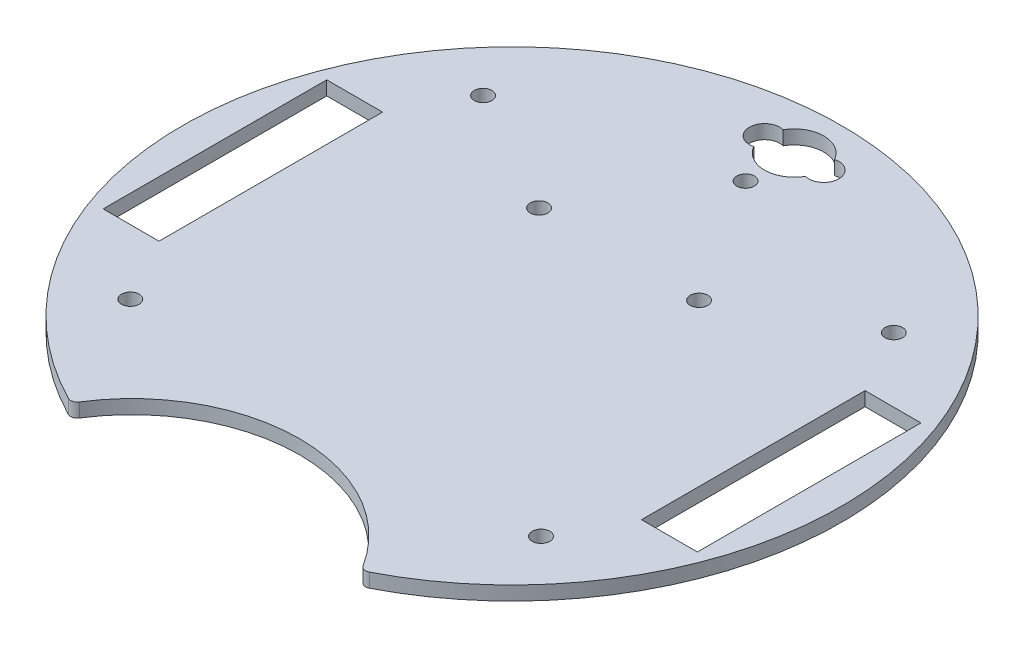
ISO-10303-21;
HEADER;
FILE_DESCRIPTION(('STEP AP214'),'2;1');
FILE_NAME('part.step','',(''),(''),'','','');
FILE_SCHEMA(('AUTOMOTIVE_DESIGN { 1 0 10303 214 1 1 1 1 }'));
ENDSEC;
DATA;
#1=APPLICATION_CONTEXT('core data for automotive mechanical design processes');
#2=APPLICATION_PROTOCOL_DEFINITION('international standard','automotive_design',2000,#1);
#3=PRODUCT_CONTEXT('',#1,'mechanical');
#4=PRODUCT('Part','Part','',(#3));
#5=PRODUCT_RELATED_PRODUCT_CATEGORY('part','',(#4));
#6=PRODUCT_DEFINITION_FORMATION('','',#4);
#7=PRODUCT_DEFINITION_CONTEXT('part definition',#1,'design');
#8=PRODUCT_DEFINITION('design','',#6,#7);
#9=PRODUCT_DEFINITION_SHAPE('','',#8);
#10=(LENGTH_UNIT() NAMED_UNIT(*) SI_UNIT(.MILLI.,.METRE.));
#11=(NAMED_UNIT(*) PLANE_ANGLE_UNIT() SI_UNIT($,.RADIAN.));
#12=(NAMED_UNIT(*) SI_UNIT($,.STERADIAN.) SOLID_ANGLE_UNIT());
#13=UNCERTAINTY_MEASURE_WITH_UNIT(LENGTH_MEASURE(1.E-05),#10,'distance_accuracy_value','');
#14=(GEOMETRIC_REPRESENTATION_CONTEXT(3) GLOBAL_UNCERTAINTY_ASSIGNED_CONTEXT((#13)) GLOBAL_UNIT_ASSIGNED_CONTEXT((#10,
#11,#12)) REPRESENTATION_CONTEXT('',''));
#15=CARTESIAN_POINT('',(0.,0.,0.));
#16=DIRECTION('',(0.,0.,1.));
#17=DIRECTION('',(1.,0.,0.));
#18=AXIS2_PLACEMENT_3D('',#15,#16,#17);
#19=CARTESIAN_POINT('',(0.,3.175,-64.1076988434385));
#20=DIRECTION('',(0.,-1.,0.));
#21=DIRECTION('',(0.,0.,-1.));
#22=AXIS2_PLACEMENT_3D('',#19,#20,#21);
#23=CYLINDRICAL_SURFACE('',#22,6.731);
#24=CARTESIAN_POINT('',(0.,0.,-64.1076988434385));
#25=DIRECTION('',(0.,1.,0.));
#26=DIRECTION('',(0.,0.,1.));
#27=AXIS2_PLACEMENT_3D('',#24,#25,#26);
#28=CIRCLE('',#27,6.731);
#29=CARTESIAN_POINT('',(-5.85389998799957,0.,-60.7853177800295));
#30=VERTEX_POINT('',#29);
#31=CARTESIAN_POINT('',(5.85757547169812,0.,-60.7918021934567));
#32=VERTEX_POINT('',#31);
#33=EDGE_CURVE('E236',#30,#32,#28,.T.);
#34=ORIENTED_EDGE('',*,*,#33,.F.);
#35=DIRECTION('',(0.,-1.,0.));
#36=VECTOR('',#35,1.);
#37=CARTESIAN_POINT('',(-5.85389998799957,3.175,-60.7853177800295));
#38=LINE('',#37,#36);
#39=CARTESIAN_POINT('',(-5.85389998799957,3.175,-60.7853177800295));
#40=VERTEX_POINT('',#39);
#41=EDGE_CURVE('E11',#40,#30,#38,.T.);
#42=ORIENTED_EDGE('',*,*,#41,.F.);
#43=CARTESIAN_POINT('',(0.,3.175,-64.1076988434385));
#44=DIRECTION('',(0.,1.,0.));
#45=DIRECTION('',(0.,0.,1.));
#46=AXIS2_PLACEMENT_3D('',#43,#44,#45);
#47=CIRCLE('',#46,6.731);
#48=CARTESIAN_POINT('',(5.85757547169812,3.175,-60.7918021934567));
#49=VERTEX_POINT('',#48);
#50=EDGE_CURVE('E171',#40,#49,#47,.T.);
#51=ORIENTED_EDGE('',*,*,#50,.T.);
#52=DIRECTION('',(0.,-1.,0.));
#53=VECTOR('',#52,1.);
#54=CARTESIAN_POINT('',(5.85757547169812,3.175,-60.7918021934567));
#55=LINE('',#54,#53);
#56=EDGE_CURVE('E54',#49,#32,#55,.T.);
#57=ORIENTED_EDGE('',*,*,#56,.T.);
#58=EDGE_LOOP('',(#34,#42,#51,#57));
#59=FACE_BOUND('',#58,.T.);
#60=ADVANCED_FACE('F35',(#59),#23,.F.);
#61=CARTESIAN_POINT('',(-6.731,3.175,-64.1076988434385));
#62=DIRECTION('',(0.,-1.,0.));
#63=DIRECTION('',(0.,0.,-1.));
#64=AXIS2_PLACEMENT_3D('',#61,#62,#63);
#65=CYLINDRICAL_SURFACE('',#64,3.43620726405579);
#66=CARTESIAN_POINT('',(-6.731,0.,-64.1076988434385));
#67=DIRECTION('',(0.,1.,0.));
#68=DIRECTION('',(0.,0.,1.));
#69=AXIS2_PLACEMENT_3D('',#66,#67,#68);
#70=CIRCLE('',#69,3.43620726405579);
#71=CARTESIAN_POINT('',(-5.85389998799957,0.,-67.4300799068475));
#72=VERTEX_POINT('',#71);
#73=EDGE_CURVE('E159',#72,#30,#70,.T.);
#74=ORIENTED_EDGE('',*,*,#73,.F.);
#75=DIRECTION('',(0.,-1.,0.));
#76=VECTOR('',#75,1.);
#77=CARTESIAN_POINT('',(-5.85389998799957,3.175,-67.4300799068475));
#78=LINE('',#77,#76);
#79=CARTESIAN_POINT('',(-5.85389998799957,3.175,-67.4300799068475));
#80=VERTEX_POINT('',#79);
#81=EDGE_CURVE('E45',#80,#72,#78,.T.);
#82=ORIENTED_EDGE('',*,*,#81,.F.);
#83=CARTESIAN_POINT('',(-6.731,3.175,-64.1076988434385));
#84=DIRECTION('',(0.,1.,0.));
#85=DIRECTION('',(0.,0.,1.));
#86=AXIS2_PLACEMENT_3D('',#83,#84,#85);
#87=CIRCLE('',#86,3.43620726405579);
#88=EDGE_CURVE('E157',#80,#40,#87,.T.);
#89=ORIENTED_EDGE('',*,*,#88,.T.);
#90=ORIENTED_EDGE('',*,*,#41,.T.);
#91=EDGE_LOOP('',(#74,#82,#89,#90));
#92=FACE_BOUND('',#91,.T.);
#93=ADVANCED_FACE('F156',(#92),#65,.F.);
#94=CARTESIAN_POINT('',(0.,3.175,-64.1076988434385));
#95=DIRECTION('',(0.,-1.,0.));
#96=DIRECTION('',(0.,0.,-1.));
#97=AXIS2_PLACEMENT_3D('',#94,#95,#96);
#98=CYLINDRICAL_SURFACE('',#97,6.731);
#99=CARTESIAN_POINT('',(0.,0.,-64.1076988434385));
#100=DIRECTION('',(0.,1.,0.));
#101=DIRECTION('',(0.,0.,1.));
#102=AXIS2_PLACEMENT_3D('',#99,#100,#101);
#103=CIRCLE('',#102,6.731);
#104=CARTESIAN_POINT('',(5.8575754716981,0.,-67.4235954934203));
#105=VERTEX_POINT('',#104);
#106=EDGE_CURVE('E239',#105,#72,#103,.T.);
#107=ORIENTED_EDGE('',*,*,#106,.F.);
#108=DIRECTION('',(0.,-1.,0.));
#109=VECTOR('',#108,1.);
#110=CARTESIAN_POINT('',(5.8575754716981,3.175,-67.4235954934203));
#111=LINE('',#110,#109);
#112=CARTESIAN_POINT('',(5.8575754716981,3.175,-67.4235954934203));
#113=VERTEX_POINT('',#112);
#114=EDGE_CURVE('E103',#113,#105,#111,.T.);
#115=ORIENTED_EDGE('',*,*,#114,.F.);
#116=CARTESIAN_POINT('',(0.,3.175,-64.1076988434385));
#117=DIRECTION('',(0.,1.,0.));
#118=DIRECTION('',(0.,0.,1.));
#119=AXIS2_PLACEMENT_3D('',#116,#117,#118);
#120=CIRCLE('',#119,6.731);
#121=EDGE_CURVE('E170',#113,#80,#120,.T.);
#122=ORIENTED_EDGE('',*,*,#121,.T.);
#123=ORIENTED_EDGE('',*,*,#81,.T.);
#124=EDGE_LOOP('',(#107,#115,#122,#123));
#125=FACE_BOUND('',#124,.T.);
#126=ADVANCED_FACE('F173',(#125),#98,.F.);
#127=CARTESIAN_POINT('',(0.,3.175,-25.4000000000001));
#128=DIRECTION('',(0.,0.,-1.));
#129=DIRECTION('',(-1.,0.,0.));
#130=AXIS2_PLACEMENT_3D('',#127,#128,#129);
#131=PLANE('',#130);
#132=DIRECTION('',(1.,0.,0.));
#133=VECTOR('',#132,1.);
#134=CARTESIAN_POINT('',(0.,0.,-25.4000000000001));
#135=LINE('',#134,#133);
#136=CARTESIAN_POINT('',(-67.5141237268841,0.,-25.4000000000001));
#137=VERTEX_POINT('',#136);
#138=CARTESIAN_POINT('',(-54.8141237268841,0.,-25.4000000000001));
#139=VERTEX_POINT('',#138);
#140=EDGE_CURVE('E225',#137,#139,#135,.T.);
#141=ORIENTED_EDGE('',*,*,#140,.T.);
#142=DIRECTION('',(0.,-1.,0.));
#143=VECTOR('',#142,1.);
#144=CARTESIAN_POINT('',(-54.8141237268841,3.175,-25.4000000000001));
#145=LINE('',#144,#143);
#146=CARTESIAN_POINT('',(-54.8141237268841,3.175,-25.4000000000001));
#147=VERTEX_POINT('',#146);
#148=EDGE_CURVE('E252',#147,#139,#145,.T.);
#149=ORIENTED_EDGE('',*,*,#148,.F.);
#150=DIRECTION('',(1.,0.,0.));
#151=VECTOR('',#150,1.);
#152=CARTESIAN_POINT('',(0.,3.175,-25.4000000000001));
#153=LINE('',#152,#151);
#154=CARTESIAN_POINT('',(-67.5141237268841,3.175,-25.4000000000001));
#155=VERTEX_POINT('',#154);
#156=EDGE_CURVE('E560',#155,#147,#153,.T.);
#157=ORIENTED_EDGE('',*,*,#156,.F.);
#158=DIRECTION('',(0.,-1.,0.));
#159=VECTOR('',#158,1.);
#160=CARTESIAN_POINT('',(-67.5141237268841,3.175,-25.4000000000001));
#161=LINE('',#160,#159);
#162=EDGE_CURVE('E254',#155,#137,#161,.T.);
#163=ORIENTED_EDGE('',*,*,#162,.T.);
#164=EDGE_LOOP('',(#141,#149,#157,#163));
#165=FACE_BOUND('',#164,.T.);
#166=ADVANCED_FACE('F330',(#165),#131,.F.);
#167=CARTESIAN_POINT('',(-54.8141237268841,3.175,0.));
#168=DIRECTION('',(1.,0.,0.));
#169=DIRECTION('',(0.,0.,-1.));
#170=AXIS2_PLACEMENT_3D('',#167,#168,#169);
#171=PLANE('',#170);
#172=DIRECTION('',(0.,0.,1.));
#173=VECTOR('',#172,1.);
#174=CARTESIAN_POINT('',(-54.8141237268841,0.,0.));
#175=LINE('',#174,#173);
#176=CARTESIAN_POINT('',(-54.8141237268841,0.,25.3999999999999));
#177=VERTEX_POINT('',#176);
#178=EDGE_CURVE('E228',#139,#177,#175,.T.);
#179=ORIENTED_EDGE('',*,*,#178,.T.);
#180=DIRECTION('',(0.,-1.,0.));
#181=VECTOR('',#180,1.);
#182=CARTESIAN_POINT('',(-54.8141237268841,3.175,25.3999999999999));
#183=LINE('',#182,#181);
#184=CARTESIAN_POINT('',(-54.8141237268841,3.175,25.3999999999999));
#185=VERTEX_POINT('',#184);
#186=EDGE_CURVE('E260',#185,#177,#183,.T.);
#187=ORIENTED_EDGE('',*,*,#186,.F.);
#188=DIRECTION('',(0.,0.,1.));
#189=VECTOR('',#188,1.);
#190=CARTESIAN_POINT('',(-54.8141237268841,3.175,0.));
#191=LINE('',#190,#189);
#192=EDGE_CURVE('E563',#147,#185,#191,.T.);
#193=ORIENTED_EDGE('',*,*,#192,.F.);
#194=ORIENTED_EDGE('',*,*,#148,.T.);
#195=EDGE_LOOP('',(#179,#187,#193,#194));
#196=FACE_BOUND('',#195,.T.);
#197=ADVANCED_FACE('F326',(#196),#171,.F.);
#198=CARTESIAN_POINT('',(0.,3.175,25.3999999999999));
#199=DIRECTION('',(0.,0.,-1.));
#200=DIRECTION('',(-1.,0.,0.));
#201=AXIS2_PLACEMENT_3D('',#198,#199,#200);
#202=PLANE('',#201);
#203=DIRECTION('',(1.,0.,0.));
#204=VECTOR('',#203,1.);
#205=CARTESIAN_POINT('',(0.,0.,25.3999999999999));
#206=LINE('',#205,#204);
#207=CARTESIAN_POINT('',(-67.5141237268841,0.,25.3999999999999));
#208=VERTEX_POINT('',#207);
#209=EDGE_CURVE('E231',#208,#177,#206,.T.);
#210=ORIENTED_EDGE('',*,*,#209,.F.);
#211=DIRECTION('',(0.,-1.,0.));
#212=VECTOR('',#211,1.);
#213=CARTESIAN_POINT('',(-67.5141237268841,3.175,25.3999999999999));
#214=LINE('',#213,#212);
#215=CARTESIAN_POINT('',(-67.5141237268841,3.175,25.3999999999999));
#216=VERTEX_POINT('',#215);
#217=EDGE_CURVE('E257',#216,#208,#214,.T.);
#218=ORIENTED_EDGE('',*,*,#217,.F.);
#219=DIRECTION('',(1.,0.,0.));
#220=VECTOR('',#219,1.);
#221=CARTESIAN_POINT('',(0.,3.175,25.3999999999999));
#222=LINE('',#221,#220);
#223=EDGE_CURVE('E572',#216,#185,#222,.T.);
#224=ORIENTED_EDGE('',*,*,#223,.T.);
#225=ORIENTED_EDGE('',*,*,#186,.T.);
#226=EDGE_LOOP('',(#210,#218,#224,#225));
#227=FACE_BOUND('',#226,.T.);
#228=ADVANCED_FACE('F322',(#227),#202,.T.);
#229=CARTESIAN_POINT('',(67.5141237268841,3.175,0.));
#230=DIRECTION('',(-1.,0.,0.));
#231=DIRECTION('',(0.,0.,1.));
#232=AXIS2_PLACEMENT_3D('',#229,#230,#231);
#233=PLANE('',#232);
#234=DIRECTION('',(0.,0.,-1.));
#235=VECTOR('',#234,1.);
#236=CARTESIAN_POINT('',(67.5141237268841,0.,0.));
#237=LINE('',#236,#235);
#238=CARTESIAN_POINT('',(67.5141237268841,0.,25.3999999999999));
#239=VERTEX_POINT('',#238);
#240=CARTESIAN_POINT('',(67.5141237268841,0.,-25.4000000000001));
#241=VERTEX_POINT('',#240);
#242=EDGE_CURVE('E213',#239,#241,#237,.T.);
#243=ORIENTED_EDGE('',*,*,#242,.F.);
#244=DIRECTION('',(0.,-1.,0.));
#245=VECTOR('',#244,1.);
#246=CARTESIAN_POINT('',(67.5141237268841,3.175,25.3999999999999));
#247=LINE('',#246,#245);
#248=CARTESIAN_POINT('',(67.5141237268841,3.175,25.3999999999999));
#249=VERTEX_POINT('',#248);
#250=EDGE_CURVE('E258',#249,#239,#247,.T.);
#251=ORIENTED_EDGE('',*,*,#250,.F.);
#252=DIRECTION('',(0.,0.,-1.));
#253=VECTOR('',#252,1.);
#254=CARTESIAN_POINT('',(67.5141237268841,3.175,0.));
#255=LINE('',#254,#253);
#256=CARTESIAN_POINT('',(67.5141237268841,3.175,-25.4000000000001));
#257=VERTEX_POINT('',#256);
#258=EDGE_CURVE('E557',#249,#257,#255,.T.);
#259=ORIENTED_EDGE('',*,*,#258,.T.);
#260=DIRECTION('',(0.,-1.,0.));
#261=VECTOR('',#260,1.);
#262=CARTESIAN_POINT('',(67.5141237268841,3.175,-25.4000000000001));
#263=LINE('',#262,#261);
#264=EDGE_CURVE('E264',#257,#241,#263,.T.);
#265=ORIENTED_EDGE('',*,*,#264,.T.);
#266=EDGE_LOOP('',(#243,#251,#259,#265));
#267=FACE_BOUND('',#266,.T.);
#268=ADVANCED_FACE('F325',(#267),#233,.T.);
#269=CARTESIAN_POINT('',(0.,3.175,25.3999999999999));
#270=DIRECTION('',(0.,0.,1.));
#271=DIRECTION('',(1.,0.,0.));
#272=AXIS2_PLACEMENT_3D('',#269,#270,#271);
#273=PLANE('',#272);
#274=DIRECTION('',(-1.,0.,0.));
#275=VECTOR('',#274,1.);
#276=CARTESIAN_POINT('',(0.,0.,25.3999999999999));
#277=LINE('',#276,#275);
#278=CARTESIAN_POINT('',(54.8141237268841,0.,25.3999999999999));
#279=VERTEX_POINT('',#278);
#280=EDGE_CURVE('E216',#239,#279,#277,.T.);
#281=ORIENTED_EDGE('',*,*,#280,.T.);
#282=DIRECTION('',(0.,-1.,0.));
#283=VECTOR('',#282,1.);
#284=CARTESIAN_POINT('',(54.8141237268841,3.175,25.3999999999999));
#285=LINE('',#284,#283);
#286=CARTESIAN_POINT('',(54.8141237268841,3.175,25.3999999999999));
#287=VERTEX_POINT('',#286);
#288=EDGE_CURVE('E268',#287,#279,#285,.T.);
#289=ORIENTED_EDGE('',*,*,#288,.F.);
#290=DIRECTION('',(-1.,0.,0.));
#291=VECTOR('',#290,1.);
#292=CARTESIAN_POINT('',(0.,3.175,25.3999999999999));
#293=LINE('',#292,#291);
#294=EDGE_CURVE('E588',#249,#287,#293,.T.);
#295=ORIENTED_EDGE('',*,*,#294,.F.);
#296=ORIENTED_EDGE('',*,*,#250,.T.);
#297=EDGE_LOOP('',(#281,#289,#295,#296));
#298=FACE_BOUND('',#297,.T.);
#299=ADVANCED_FACE('F342',(#298),#273,.F.);
#300=CARTESIAN_POINT('',(54.8141237268841,3.175,0.));
#301=DIRECTION('',(-1.,0.,0.));
#302=DIRECTION('',(0.,0.,1.));
#303=AXIS2_PLACEMENT_3D('',#300,#301,#302);
#304=PLANE('',#303);
#305=DIRECTION('',(0.,0.,-1.));
#306=VECTOR('',#305,1.);
#307=CARTESIAN_POINT('',(54.8141237268841,0.,0.));
#308=LINE('',#307,#306);
#309=CARTESIAN_POINT('',(54.8141237268841,0.,-25.4000000000001));
#310=VERTEX_POINT('',#309);
#311=EDGE_CURVE('E219',#279,#310,#308,.T.);
#312=ORIENTED_EDGE('',*,*,#311,.T.);
#313=DIRECTION('',(0.,-1.,0.));
#314=VECTOR('',#313,1.);
#315=CARTESIAN_POINT('',(54.8141237268841,3.175,-25.4000000000001));
#316=LINE('',#315,#314);
#317=CARTESIAN_POINT('',(54.8141237268841,3.175,-25.4000000000001));
#318=VERTEX_POINT('',#317);
#319=EDGE_CURVE('E266',#318,#310,#316,.T.);
#320=ORIENTED_EDGE('',*,*,#319,.F.);
#321=DIRECTION('',(0.,0.,-1.));
#322=VECTOR('',#321,1.);
#323=CARTESIAN_POINT('',(54.8141237268841,3.175,0.));
#324=LINE('',#323,#322);
#325=EDGE_CURVE('E586',#287,#318,#324,.T.);
#326=ORIENTED_EDGE('',*,*,#325,.F.);
#327=ORIENTED_EDGE('',*,*,#288,.T.);
#328=EDGE_LOOP('',(#312,#320,#326,#327));
#329=FACE_BOUND('',#328,.T.);
#330=ADVANCED_FACE('F339',(#329),#304,.F.);
#331=CARTESIAN_POINT('',(33.5100001196225,3.175,65.3012960955778));
#332=DIRECTION('',(0.,-1.,0.));
#333=DIRECTION('',(0.,0.,-1.));
#334=AXIS2_PLACEMENT_3D('',#331,#332,#333);
#335=CYLINDRICAL_SURFACE('',#334,1.50000000000011);
#336=CARTESIAN_POINT('',(33.5100001196225,0.,65.3012960955778));
#337=DIRECTION('',(0.,1.,0.));
#338=DIRECTION('',(0.,0.,1.));
#339=AXIS2_PLACEMENT_3D('',#336,#337,#338);
#340=CIRCLE('',#339,1.50000000000011);
#341=CARTESIAN_POINT('',(34.1948335778492,0.,66.6358383895849));
#342=VERTEX_POINT('',#341);
#343=CARTESIAN_POINT('',(32.2406819332729,0.,66.100565350462));
#344=VERTEX_POINT('',#343);
#345=EDGE_CURVE('E192',#342,#344,#340,.F.);
#346=ORIENTED_EDGE('',*,*,#345,.F.);
#347=DIRECTION('',(0.,-1.,0.));
#348=VECTOR('',#347,1.);
#349=CARTESIAN_POINT('',(34.1948335778492,3.175,66.6358383895849));
#350=LINE('',#349,#348);
#351=CARTESIAN_POINT('',(34.1948335778492,3.175,66.6358383895849));
#352=VERTEX_POINT('',#351);
#353=EDGE_CURVE('E39',#352,#342,#350,.T.);
#354=ORIENTED_EDGE('',*,*,#353,.F.);
#355=CARTESIAN_POINT('',(33.5100001196225,3.175,65.3012960955778));
#356=DIRECTION('',(0.,1.,0.));
#357=DIRECTION('',(0.,0.,1.));
#358=AXIS2_PLACEMENT_3D('',#355,#356,#357);
#359=CIRCLE('',#358,1.50000000000011);
#360=CARTESIAN_POINT('',(32.2406819332729,3.175,66.100565350462));
#361=VERTEX_POINT('',#360);
#362=EDGE_CURVE('E289',#352,#361,#359,.F.);
#363=ORIENTED_EDGE('',*,*,#362,.T.);
#364=DIRECTION('',(0.,-1.,0.));
#365=VECTOR('',#364,1.);
#366=CARTESIAN_POINT('',(32.2406819332729,3.175,66.100565350462));
#367=LINE('',#366,#365);
#368=EDGE_CURVE('E185',#361,#344,#367,.T.);
#369=ORIENTED_EDGE('',*,*,#368,.T.);
#370=EDGE_LOOP('',(#346,#354,#363,#369));
#371=FACE_BOUND('',#370,.T.);
#372=ADVANCED_FACE('F288',(#371),#335,.T.);
#373=CARTESIAN_POINT('',(0.,3.175,0.));
#374=DIRECTION('',(0.,-1.,0.));
#375=DIRECTION('',(0.,0.,-1.));
#376=AXIS2_PLACEMENT_3D('',#373,#374,#375);
#377=CYLINDRICAL_SURFACE('',#376,74.8974071734108);
#378=CARTESIAN_POINT('',(0.,0.,0.));
#379=DIRECTION('',(0.,1.,0.));
#380=DIRECTION('',(0.,0.,1.));
#381=AXIS2_PLACEMENT_3D('',#378,#379,#380);
#382=CIRCLE('',#381,74.8974071734108);
#383=CARTESIAN_POINT('',(-34.1948335778492,0.,66.6358383895849));
#384=VERTEX_POINT('',#383);
#385=EDGE_CURVE('E195',#342,#384,#382,.T.);
#386=ORIENTED_EDGE('',*,*,#385,.T.);
#387=DIRECTION('',(0.,-1.,0.));
#388=VECTOR('',#387,1.);
#389=CARTESIAN_POINT('',(-34.1948335778492,3.175,66.6358383895849));
#390=LINE('',#389,#388);
#391=CARTESIAN_POINT('',(-34.1948335778492,3.175,66.6358383895849));
#392=VERTEX_POINT('',#391);
#393=EDGE_CURVE('E274',#392,#384,#390,.T.);
#394=ORIENTED_EDGE('',*,*,#393,.F.);
#395=CARTESIAN_POINT('',(0.,3.175,0.));
#396=DIRECTION('',(0.,1.,0.));
#397=DIRECTION('',(0.,0.,1.));
#398=AXIS2_PLACEMENT_3D('',#395,#396,#397);
#399=CIRCLE('',#398,74.8974071734108);
#400=EDGE_CURVE('E282',#352,#392,#399,.T.);
#401=ORIENTED_EDGE('',*,*,#400,.F.);
#402=ORIENTED_EDGE('',*,*,#353,.T.);
#403=EDGE_LOOP('',(#386,#394,#401,#402));
#404=FACE_BOUND('',#403,.T.);
#405=ADVANCED_FACE('F280',(#404),#377,.T.);
#406=CARTESIAN_POINT('',(-33.5100001196225,3.175,65.3012960955779));
#407=DIRECTION('',(0.,-1.,0.));
#408=DIRECTION('',(0.,0.,-1.));
#409=AXIS2_PLACEMENT_3D('',#406,#407,#408);
#410=CYLINDRICAL_SURFACE('',#409,1.50000000000026);
#411=CARTESIAN_POINT('',(-33.5100001196225,0.,65.3012960955779));
#412=DIRECTION('',(0.,1.,0.));
#413=DIRECTION('',(0.,0.,1.));
#414=AXIS2_PLACEMENT_3D('',#411,#412,#413);
#415=CIRCLE('',#414,1.50000000000026);
#416=CARTESIAN_POINT('',(-32.2406819332729,0.,66.100565350462));
#417=VERTEX_POINT('',#416);
#418=EDGE_CURVE('E198',#384,#417,#415,.T.);
#419=ORIENTED_EDGE('',*,*,#418,.T.);
#420=DIRECTION('',(0.,-1.,0.));
#421=VECTOR('',#420,1.);
#422=CARTESIAN_POINT('',(-32.2406819332729,3.175,66.100565350462));
#423=LINE('',#422,#421);
#424=CARTESIAN_POINT('',(-32.2406819332729,3.175,66.100565350462));
#425=VERTEX_POINT('',#424);
#426=EDGE_CURVE('E273',#425,#417,#423,.T.);
#427=ORIENTED_EDGE('',*,*,#426,.F.);
#428=CARTESIAN_POINT('',(-33.5100001196225,3.175,65.3012960955779));
#429=DIRECTION('',(0.,1.,0.));
#430=DIRECTION('',(0.,0.,1.));
#431=AXIS2_PLACEMENT_3D('',#428,#429,#430);
#432=CIRCLE('',#431,1.50000000000026);
#433=EDGE_CURVE('E595',#392,#425,#432,.T.);
#434=ORIENTED_EDGE('',*,*,#433,.F.);
#435=ORIENTED_EDGE('',*,*,#393,.T.);
#436=EDGE_LOOP('',(#419,#427,#434,#435));
#437=FACE_BOUND('',#436,.T.);
#438=ADVANCED_FACE('F296',(#437),#410,.T.);
#439=CARTESIAN_POINT('',(-18.1789527954067,3.175,-24.3105510962522));
#440=DIRECTION('',(0.,-1.,0.));
#441=DIRECTION('',(0.,0.,-1.));
#442=AXIS2_PLACEMENT_3D('',#439,#440,#441);
#443=CYLINDRICAL_SURFACE('',#442,2.);
#444=CARTESIAN_POINT('',(-18.1789527954067,3.175,-24.3105510962522));
#445=DIRECTION('',(0.,1.,0.));
#446=DIRECTION('',(0.,0.,1.));
#447=AXIS2_PLACEMENT_3D('',#444,#445,#446);
#448=CIRCLE('',#447,2.);
#449=CARTESIAN_POINT('',(-18.1789527954067,3.175,-22.3105510962522));
#450=VERTEX_POINT('',#449);
#451=EDGE_CURVE('E176',#450,#450,#448,.F.);
#452=ORIENTED_EDGE('',*,*,#451,.F.);
#453=EDGE_LOOP('',(#452));
#454=FACE_BOUND('',#453,.T.);
#455=CARTESIAN_POINT('',(-18.1789527954067,0.,-24.3105510962522));
#456=DIRECTION('',(0.,1.,0.));
#457=DIRECTION('',(0.,0.,1.));
#458=AXIS2_PLACEMENT_3D('',#455,#456,#457);
#459=CIRCLE('',#458,2.);
#460=CARTESIAN_POINT('',(-18.1789527954067,0.,-22.3105510962522));
#461=VERTEX_POINT('',#460);
#462=EDGE_CURVE('E244',#461,#461,#459,.F.);
#463=ORIENTED_EDGE('',*,*,#462,.T.);
#464=EDGE_LOOP('',(#463));
#465=FACE_BOUND('',#464,.T.);
#466=ADVANCED_FACE('F298',(#454,#465),#443,.F.);
#467=CARTESIAN_POINT('',(6.731,3.175,-64.1076988434385));
#468=DIRECTION('',(0.,-1.,0.));
#469=DIRECTION('',(0.,0.,-1.));
#470=AXIS2_PLACEMENT_3D('',#467,#468,#469);
#471=CYLINDRICAL_SURFACE('',#470,3.429);
#472=CARTESIAN_POINT('',(6.731,0.,-64.1076988434385));
#473=DIRECTION('',(0.,1.,0.));
#474=DIRECTION('',(0.,0.,1.));
#475=AXIS2_PLACEMENT_3D('',#472,#473,#474);
#476=CIRCLE('',#475,3.429);
#477=EDGE_CURVE('E241',#32,#105,#476,.T.);
#478=ORIENTED_EDGE('',*,*,#477,.F.);
#479=ORIENTED_EDGE('',*,*,#56,.F.);
#480=CARTESIAN_POINT('',(6.731,3.175,-64.1076988434385));
#481=DIRECTION('',(0.,1.,0.));
#482=DIRECTION('',(0.,0.,1.));
#483=AXIS2_PLACEMENT_3D('',#480,#481,#482);
#484=CIRCLE('',#483,3.429);
#485=EDGE_CURVE('E174',#49,#113,#484,.T.);
#486=ORIENTED_EDGE('',*,*,#485,.T.);
#487=ORIENTED_EDGE('',*,*,#114,.T.);
#488=EDGE_LOOP('',(#478,#479,#486,#487));
#489=FACE_BOUND('',#488,.T.);
#490=ADVANCED_FACE('F304',(#489),#471,.F.);
#491=CARTESIAN_POINT('',(-67.5141237268841,3.175,0.));
#492=DIRECTION('',(-1.,0.,0.));
#493=DIRECTION('',(0.,0.,1.));
#494=AXIS2_PLACEMENT_3D('',#491,#492,#493);
#495=PLANE('',#494);
#496=DIRECTION('',(0.,0.,-1.));
#497=VECTOR('',#496,1.);
#498=CARTESIAN_POINT('',(-67.5141237268841,0.,0.));
#499=LINE('',#498,#497);
#500=EDGE_CURVE('E234',#208,#137,#499,.T.);
#501=ORIENTED_EDGE('',*,*,#500,.T.);
#502=ORIENTED_EDGE('',*,*,#162,.F.);
#503=DIRECTION('',(0.,0.,-1.));
#504=VECTOR('',#503,1.);
#505=CARTESIAN_POINT('',(-67.5141237268841,3.175,0.));
#506=LINE('',#505,#504);
#507=EDGE_CURVE('E566',#216,#155,#506,.T.);
#508=ORIENTED_EDGE('',*,*,#507,.F.);
#509=ORIENTED_EDGE('',*,*,#217,.T.);
#510=EDGE_LOOP('',(#501,#502,#508,#509));
#511=FACE_BOUND('',#510,.T.);
#512=ADVANCED_FACE('F317',(#511),#495,.F.);
#513=CARTESIAN_POINT('',(0.,3.175,-25.4000000000001));
#514=DIRECTION('',(0.,0.,1.));
#515=DIRECTION('',(1.,0.,0.));
#516=AXIS2_PLACEMENT_3D('',#513,#514,#515);
#517=PLANE('',#516);
#518=DIRECTION('',(-1.,0.,0.));
#519=VECTOR('',#518,1.);
#520=CARTESIAN_POINT('',(0.,0.,-25.4000000000001));
#521=LINE('',#520,#519);
#522=EDGE_CURVE('E222',#241,#310,#521,.T.);
#523=ORIENTED_EDGE('',*,*,#522,.F.);
#524=ORIENTED_EDGE('',*,*,#264,.F.);
#525=DIRECTION('',(-1.,0.,0.));
#526=VECTOR('',#525,1.);
#527=CARTESIAN_POINT('',(0.,3.175,-25.4000000000001));
#528=LINE('',#527,#526);
#529=EDGE_CURVE('E568',#257,#318,#528,.T.);
#530=ORIENTED_EDGE('',*,*,#529,.T.);
#531=ORIENTED_EDGE('',*,*,#319,.T.);
#532=EDGE_LOOP('',(#523,#524,#530,#531));
#533=FACE_BOUND('',#532,.T.);
#534=ADVANCED_FACE('F320',(#533),#517,.T.);
#535=CARTESIAN_POINT('',(-46.6637339832601,3.175,40.0812318826666));
#536=DIRECTION('',(0.,-1.,0.));
#537=DIRECTION('',(0.,0.,-1.));
#538=AXIS2_PLACEMENT_3D('',#535,#536,#537);
#539=CYLINDRICAL_SURFACE('',#538,2.);
#540=CARTESIAN_POINT('',(-46.6637339832601,3.175,40.0812318826666));
#541=DIRECTION('',(0.,1.,0.));
#542=DIRECTION('',(0.,0.,1.));
#543=AXIS2_PLACEMENT_3D('',#540,#541,#542);
#544=CIRCLE('',#543,2.);
#545=CARTESIAN_POINT('',(-46.6637339832601,3.175,42.0812318826666));
#546=VERTEX_POINT('',#545);
#547=EDGE_CURVE('E551',#546,#546,#544,.T.);
#548=ORIENTED_EDGE('',*,*,#547,.T.);
#549=EDGE_LOOP('',(#548));
#550=FACE_BOUND('',#549,.T.);
#551=CARTESIAN_POINT('',(-46.6637339832601,0.,40.0812318826666));
#552=DIRECTION('',(0.,1.,0.));
#553=DIRECTION('',(0.,0.,1.));
#554=AXIS2_PLACEMENT_3D('',#551,#552,#553);
#555=CIRCLE('',#554,2.);
#556=CARTESIAN_POINT('',(-46.6637339832601,0.,42.0812318826666));
#557=VERTEX_POINT('',#556);
#558=EDGE_CURVE('E210',#557,#557,#555,.T.);
#559=ORIENTED_EDGE('',*,*,#558,.F.);
#560=EDGE_LOOP('',(#559));
#561=FACE_BOUND('',#560,.T.);
#562=ADVANCED_FACE('F337',(#550,#561),#539,.F.);
#563=CARTESIAN_POINT('',(46.6637339832601,3.175,40.0812318826666));
#564=DIRECTION('',(0.,-1.,0.));
#565=DIRECTION('',(0.,0.,-1.));
#566=AXIS2_PLACEMENT_3D('',#563,#564,#565);
#567=CYLINDRICAL_SURFACE('',#566,2.);
#568=CARTESIAN_POINT('',(46.6637339832601,3.175,40.0812318826666));
#569=DIRECTION('',(0.,1.,0.));
#570=DIRECTION('',(0.,0.,1.));
#571=AXIS2_PLACEMENT_3D('',#568,#569,#570);
#572=CIRCLE('',#571,2.);
#573=CARTESIAN_POINT('',(46.6637339832601,3.175,42.0812318826666));
#574=VERTEX_POINT('',#573);
#575=EDGE_CURVE('E547',#574,#574,#572,.T.);
#576=ORIENTED_EDGE('',*,*,#575,.T.);
#577=EDGE_LOOP('',(#576));
#578=FACE_BOUND('',#577,.T.);
#579=CARTESIAN_POINT('',(46.6637339832601,0.,40.0812318826666));
#580=DIRECTION('',(0.,1.,0.));
#581=DIRECTION('',(0.,0.,1.));
#582=AXIS2_PLACEMENT_3D('',#579,#580,#581);
#583=CIRCLE('',#582,2.);
#584=CARTESIAN_POINT('',(46.6637339832601,0.,42.0812318826666));
#585=VERTEX_POINT('',#584);
#586=EDGE_CURVE('E207',#585,#585,#583,.T.);
#587=ORIENTED_EDGE('',*,*,#586,.F.);
#588=EDGE_LOOP('',(#587));
#589=FACE_BOUND('',#588,.T.);
#590=ADVANCED_FACE('F352',(#578,#589),#567,.F.);
#591=CARTESIAN_POINT('',(46.6637339832601,3.175,-40.0812318826666));
#592=DIRECTION('',(0.,-1.,0.));
#593=DIRECTION('',(0.,0.,-1.));
#594=AXIS2_PLACEMENT_3D('',#591,#592,#593);
#595=CYLINDRICAL_SURFACE('',#594,2.);
#596=CARTESIAN_POINT('',(46.6637339832601,3.175,-40.0812318826666));
#597=DIRECTION('',(0.,1.,0.));
#598=DIRECTION('',(0.,0.,1.));
#599=AXIS2_PLACEMENT_3D('',#596,#597,#598);
#600=CIRCLE('',#599,2.);
#601=CARTESIAN_POINT('',(46.6637339832601,3.175,-38.0812318826666));
#602=VERTEX_POINT('',#601);
#603=EDGE_CURVE('E543',#602,#602,#600,.F.);
#604=ORIENTED_EDGE('',*,*,#603,.F.);
#605=EDGE_LOOP('',(#604));
#606=FACE_BOUND('',#605,.T.);
#607=CARTESIAN_POINT('',(46.6637339832601,0.,-40.0812318826666));
#608=DIRECTION('',(0.,1.,0.));
#609=DIRECTION('',(0.,0.,1.));
#610=AXIS2_PLACEMENT_3D('',#607,#608,#609);
#611=CIRCLE('',#610,2.);
#612=CARTESIAN_POINT('',(46.6637339832601,0.,-38.0812318826666));
#613=VERTEX_POINT('',#612);
#614=EDGE_CURVE('E204',#613,#613,#611,.F.);
#615=ORIENTED_EDGE('',*,*,#614,.T.);
#616=EDGE_LOOP('',(#615));
#617=FACE_BOUND('',#616,.T.);
#618=ADVANCED_FACE('F356',(#606,#617),#595,.F.);
#619=CARTESIAN_POINT('',(0.,3.175,86.4020044245157));
#620=DIRECTION('',(0.,-1.,0.));
#621=DIRECTION('',(0.,0.,-1.));
#622=AXIS2_PLACEMENT_3D('',#619,#620,#621);
#623=CYLINDRICAL_SURFACE('',#622,38.0999999999998);
#624=CARTESIAN_POINT('',(0.,0.,86.4020044245157));
#625=DIRECTION('',(0.,1.,0.));
#626=DIRECTION('',(0.,0.,1.));
#627=AXIS2_PLACEMENT_3D('',#624,#625,#626);
#628=CIRCLE('',#627,38.0999999999998);
#629=EDGE_CURVE('E201',#344,#417,#628,.T.);
#630=ORIENTED_EDGE('',*,*,#629,.F.);
#631=ORIENTED_EDGE('',*,*,#368,.F.);
#632=CARTESIAN_POINT('',(0.,3.175,86.4020044245157));
#633=DIRECTION('',(0.,1.,0.));
#634=DIRECTION('',(0.,0.,1.));
#635=AXIS2_PLACEMENT_3D('',#632,#633,#634);
#636=CIRCLE('',#635,38.0999999999998);
#637=EDGE_CURVE('E294',#361,#425,#636,.T.);
#638=ORIENTED_EDGE('',*,*,#637,.T.);
#639=ORIENTED_EDGE('',*,*,#426,.T.);
#640=EDGE_LOOP('',(#630,#631,#638,#639));
#641=FACE_BOUND('',#640,.T.);
#642=ADVANCED_FACE('F293',(#641),#623,.F.);
#643=CARTESIAN_POINT('',(18.1789527954067,3.175,-24.3105510962522));
#644=DIRECTION('',(0.,-1.,0.));
#645=DIRECTION('',(0.,0.,-1.));
#646=AXIS2_PLACEMENT_3D('',#643,#644,#645);
#647=CYLINDRICAL_SURFACE('',#646,2.);
#648=CARTESIAN_POINT('',(18.1789527954067,3.175,-24.3105510962522));
#649=DIRECTION('',(0.,1.,0.));
#650=DIRECTION('',(0.,0.,1.));
#651=AXIS2_PLACEMENT_3D('',#648,#649,#650);
#652=CIRCLE('',#651,2.);
#653=CARTESIAN_POINT('',(18.1789527954067,3.175,-22.3105510962522));
#654=VERTEX_POINT('',#653);
#655=EDGE_CURVE('E538',#654,#654,#652,.T.);
#656=ORIENTED_EDGE('',*,*,#655,.T.);
#657=EDGE_LOOP('',(#656));
#658=FACE_BOUND('',#657,.T.);
#659=CARTESIAN_POINT('',(18.1789527954067,0.,-24.3105510962522));
#660=DIRECTION('',(0.,1.,0.));
#661=DIRECTION('',(0.,0.,1.));
#662=AXIS2_PLACEMENT_3D('',#659,#660,#661);
#663=CIRCLE('',#662,2.);
#664=CARTESIAN_POINT('',(18.1789527954067,0.,-22.3105510962522));
#665=VERTEX_POINT('',#664);
#666=EDGE_CURVE('E189',#665,#665,#663,.T.);
#667=ORIENTED_EDGE('',*,*,#666,.F.);
#668=EDGE_LOOP('',(#667));
#669=FACE_BOUND('',#668,.T.);
#670=ADVANCED_FACE('F361',(#658,#669),#647,.F.);
#671=CARTESIAN_POINT('',(0.,3.175,-53.0611879648997));
#672=DIRECTION('',(0.,-1.,0.));
#673=DIRECTION('',(0.,0.,-1.));
#674=AXIS2_PLACEMENT_3D('',#671,#672,#673);
#675=CYLINDRICAL_SURFACE('',#674,2.);
#676=CARTESIAN_POINT('',(0.,3.175,-53.0611879648997));
#677=DIRECTION('',(0.,1.,0.));
#678=DIRECTION('',(0.,0.,1.));
#679=AXIS2_PLACEMENT_3D('',#676,#677,#678);
#680=CIRCLE('',#679,2.);
#681=CARTESIAN_POINT('',(0.,3.175,-51.0611879648997));
#682=VERTEX_POINT('',#681);
#683=EDGE_CURVE('E250',#682,#682,#680,.T.);
#684=ORIENTED_EDGE('',*,*,#683,.T.);
#685=EDGE_LOOP('',(#684));
#686=FACE_BOUND('',#685,.T.);
#687=CARTESIAN_POINT('',(0.,0.,-53.0611879648997));
#688=DIRECTION('',(0.,1.,0.));
#689=DIRECTION('',(0.,0.,1.));
#690=AXIS2_PLACEMENT_3D('',#687,#688,#689);
#691=CIRCLE('',#690,2.);
#692=CARTESIAN_POINT('',(0.,0.,-51.0611879648997));
#693=VERTEX_POINT('',#692);
#694=EDGE_CURVE('E186',#693,#693,#691,.T.);
#695=ORIENTED_EDGE('',*,*,#694,.F.);
#696=EDGE_LOOP('',(#695));
#697=FACE_BOUND('',#696,.T.);
#698=ADVANCED_FACE('F37',(#686,#697),#675,.F.);
#699=CARTESIAN_POINT('',(-46.6637339832601,3.175,-40.0812318826666));
#700=DIRECTION('',(0.,-1.,0.));
#701=DIRECTION('',(0.,0.,-1.));
#702=AXIS2_PLACEMENT_3D('',#699,#700,#701);
#703=CYLINDRICAL_SURFACE('',#702,2.);
#704=CARTESIAN_POINT('',(-46.6637339832601,3.175,-40.0812318826666));
#705=DIRECTION('',(0.,1.,0.));
#706=DIRECTION('',(0.,0.,1.));
#707=AXIS2_PLACEMENT_3D('',#704,#705,#706);
#708=CIRCLE('',#707,2.);
#709=CARTESIAN_POINT('',(-46.6637339832601,3.175,-38.0812318826666));
#710=VERTEX_POINT('',#709);
#711=EDGE_CURVE('E182',#710,#710,#708,.F.);
#712=ORIENTED_EDGE('',*,*,#711,.F.);
#713=EDGE_LOOP('',(#712));
#714=FACE_BOUND('',#713,.T.);
#715=CARTESIAN_POINT('',(-46.6637339832601,0.,-40.0812318826666));
#716=DIRECTION('',(0.,1.,0.));
#717=DIRECTION('',(0.,0.,1.));
#718=AXIS2_PLACEMENT_3D('',#715,#716,#717);
#719=CIRCLE('',#718,2.);
#720=CARTESIAN_POINT('',(-46.6637339832601,0.,-38.0812318826666));
#721=VERTEX_POINT('',#720);
#722=EDGE_CURVE('E247',#721,#721,#719,.F.);
#723=ORIENTED_EDGE('',*,*,#722,.T.);
#724=EDGE_LOOP('',(#723));
#725=FACE_BOUND('',#724,.T.);
#726=ADVANCED_FACE('F369',(#714,#725),#703,.F.);
#727=CARTESIAN_POINT('',(0.,3.175,0.));
#728=DIRECTION('',(0.,1.,0.));
#729=DIRECTION('',(0.,0.,1.));
#730=AXIS2_PLACEMENT_3D('',#727,#728,#729);
#731=PLANE('',#730);
#732=ORIENTED_EDGE('',*,*,#683,.F.);
#733=EDGE_LOOP('',(#732));
#734=FACE_BOUND('',#733,.T.);
#735=ORIENTED_EDGE('',*,*,#655,.F.);
#736=EDGE_LOOP('',(#735));
#737=FACE_BOUND('',#736,.T.);
#738=ORIENTED_EDGE('',*,*,#362,.F.);
#739=ORIENTED_EDGE('',*,*,#400,.T.);
#740=ORIENTED_EDGE('',*,*,#433,.T.);
#741=ORIENTED_EDGE('',*,*,#637,.F.);
#742=EDGE_LOOP('',(#738,#739,#740,#741));
#743=FACE_BOUND('',#742,.T.);
#744=ORIENTED_EDGE('',*,*,#603,.T.);
#745=EDGE_LOOP('',(#744));
#746=FACE_BOUND('',#745,.T.);
#747=ORIENTED_EDGE('',*,*,#575,.F.);
#748=EDGE_LOOP('',(#747));
#749=FACE_BOUND('',#748,.T.);
#750=ORIENTED_EDGE('',*,*,#547,.F.);
#751=EDGE_LOOP('',(#750));
#752=FACE_BOUND('',#751,.T.);
#753=ORIENTED_EDGE('',*,*,#258,.F.);
#754=ORIENTED_EDGE('',*,*,#294,.T.);
#755=ORIENTED_EDGE('',*,*,#325,.T.);
#756=ORIENTED_EDGE('',*,*,#529,.F.);
#757=EDGE_LOOP('',(#753,#754,#755,#756));
#758=FACE_BOUND('',#757,.T.);
#759=ORIENTED_EDGE('',*,*,#156,.T.);
#760=ORIENTED_EDGE('',*,*,#192,.T.);
#761=ORIENTED_EDGE('',*,*,#223,.F.);
#762=ORIENTED_EDGE('',*,*,#507,.T.);
#763=EDGE_LOOP('',(#759,#760,#761,#762));
#764=FACE_BOUND('',#763,.T.);
#765=ORIENTED_EDGE('',*,*,#50,.F.);
#766=ORIENTED_EDGE('',*,*,#88,.F.);
#767=ORIENTED_EDGE('',*,*,#121,.F.);
#768=ORIENTED_EDGE('',*,*,#485,.F.);
#769=EDGE_LOOP('',(#765,#766,#767,#768));
#770=FACE_BOUND('',#769,.T.);
#771=ORIENTED_EDGE('',*,*,#451,.T.);
#772=EDGE_LOOP('',(#771));
#773=FACE_BOUND('',#772,.T.);
#774=ORIENTED_EDGE('',*,*,#711,.T.);
#775=EDGE_LOOP('',(#774));
#776=FACE_BOUND('',#775,.T.);
#777=ADVANCED_FACE('F167',(#734,#737,#743,#746,#749,#752,#758,#764,#770,#773,#776),#731,.T.);
#778=CARTESIAN_POINT('',(0.,0.,0.));
#779=DIRECTION('',(0.,1.,0.));
#780=DIRECTION('',(0.,0.,1.));
#781=AXIS2_PLACEMENT_3D('',#778,#779,#780);
#782=PLANE('',#781);
#783=ORIENTED_EDGE('',*,*,#694,.T.);
#784=EDGE_LOOP('',(#783));
#785=FACE_BOUND('',#784,.T.);
#786=ORIENTED_EDGE('',*,*,#666,.T.);
#787=EDGE_LOOP('',(#786));
#788=FACE_BOUND('',#787,.T.);
#789=ORIENTED_EDGE('',*,*,#345,.T.);
#790=ORIENTED_EDGE('',*,*,#629,.T.);
#791=ORIENTED_EDGE('',*,*,#418,.F.);
#792=ORIENTED_EDGE('',*,*,#385,.F.);
#793=EDGE_LOOP('',(#789,#790,#791,#792));
#794=FACE_BOUND('',#793,.T.);
#795=ORIENTED_EDGE('',*,*,#614,.F.);
#796=EDGE_LOOP('',(#795));
#797=FACE_BOUND('',#796,.T.);
#798=ORIENTED_EDGE('',*,*,#586,.T.);
#799=EDGE_LOOP('',(#798));
#800=FACE_BOUND('',#799,.T.);
#801=ORIENTED_EDGE('',*,*,#558,.T.);
#802=EDGE_LOOP('',(#801));
#803=FACE_BOUND('',#802,.T.);
#804=ORIENTED_EDGE('',*,*,#242,.T.);
#805=ORIENTED_EDGE('',*,*,#522,.T.);
#806=ORIENTED_EDGE('',*,*,#311,.F.);
#807=ORIENTED_EDGE('',*,*,#280,.F.);
#808=EDGE_LOOP('',(#804,#805,#806,#807));
#809=FACE_BOUND('',#808,.T.);
#810=ORIENTED_EDGE('',*,*,#140,.F.);
#811=ORIENTED_EDGE('',*,*,#500,.F.);
#812=ORIENTED_EDGE('',*,*,#209,.T.);
#813=ORIENTED_EDGE('',*,*,#178,.F.);
#814=EDGE_LOOP('',(#810,#811,#812,#813));
#815=FACE_BOUND('',#814,.T.);
#816=ORIENTED_EDGE('',*,*,#33,.T.);
#817=ORIENTED_EDGE('',*,*,#477,.T.);
#818=ORIENTED_EDGE('',*,*,#106,.T.);
#819=ORIENTED_EDGE('',*,*,#73,.T.);
#820=EDGE_LOOP('',(#816,#817,#818,#819));
#821=FACE_BOUND('',#820,.T.);
#822=ORIENTED_EDGE('',*,*,#462,.F.);
#823=EDGE_LOOP('',(#822));
#824=FACE_BOUND('',#823,.T.);
#825=ORIENTED_EDGE('',*,*,#722,.F.);
#826=EDGE_LOOP('',(#825));
#827=FACE_BOUND('',#826,.T.);
#828=ADVANCED_FACE('F285',(#785,#788,#794,#797,#800,#803,#809,#815,#821,#824,#827),#782,.F.);
#829=CLOSED_SHELL('',(#60,#93,#126,#166,#197,#228,#268,#299,#330,#372,#405,#438,#466,#490,#512,
#534,#562,#590,#618,#642,#670,#698,#726,#777,#828));
#830=MANIFOLD_SOLID_BREP('B2',#829);
#831=ADVANCED_BREP_SHAPE_REPRESENTATION('',(#18,#830),#14);
#832=SHAPE_DEFINITION_REPRESENTATION(#9,#831);
ENDSEC;
END-ISO-10303-21;
